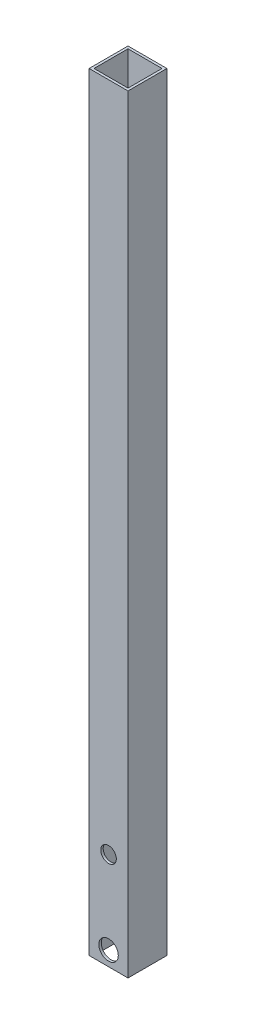
ISO-10303-21;
HEADER;
FILE_DESCRIPTION(('STEP AP214'),'2;1');
FILE_NAME('part.step','',(''),(''),'','','');
FILE_SCHEMA(('AUTOMOTIVE_DESIGN { 1 0 10303 214 1 1 1 1 }'));
ENDSEC;
DATA;
#1=APPLICATION_CONTEXT('core data for automotive mechanical design processes');
#2=APPLICATION_PROTOCOL_DEFINITION('international standard','automotive_design',2000,#1);
#3=PRODUCT_CONTEXT('',#1,'mechanical');
#4=PRODUCT('Part','Part','',(#3));
#5=PRODUCT_RELATED_PRODUCT_CATEGORY('part','',(#4));
#6=PRODUCT_DEFINITION_FORMATION('','',#4);
#7=PRODUCT_DEFINITION_CONTEXT('part definition',#1,'design');
#8=PRODUCT_DEFINITION('design','',#6,#7);
#9=PRODUCT_DEFINITION_SHAPE('','',#8);
#10=(LENGTH_UNIT() NAMED_UNIT(*) SI_UNIT(.MILLI.,.METRE.));
#11=(NAMED_UNIT(*) PLANE_ANGLE_UNIT() SI_UNIT($,.RADIAN.));
#12=(NAMED_UNIT(*) SI_UNIT($,.STERADIAN.) SOLID_ANGLE_UNIT());
#13=UNCERTAINTY_MEASURE_WITH_UNIT(LENGTH_MEASURE(1.E-05),#10,'distance_accuracy_value','');
#14=(GEOMETRIC_REPRESENTATION_CONTEXT(3) GLOBAL_UNCERTAINTY_ASSIGNED_CONTEXT((#13)) GLOBAL_UNIT_ASSIGNED_CONTEXT((#10,
#11,#12)) REPRESENTATION_CONTEXT('',''));
#15=CARTESIAN_POINT('',(0.,0.,0.));
#16=DIRECTION('',(0.,0.,1.));
#17=DIRECTION('',(1.,0.,0.));
#18=AXIS2_PLACEMENT_3D('',#15,#16,#17);
#19=CARTESIAN_POINT('',(0.,501.65,0.));
#20=DIRECTION('',(0.,1.,0.));
#21=DIRECTION('',(0.,0.,1.));
#22=AXIS2_PLACEMENT_3D('',#19,#20,#21);
#23=PLANE('',#22);
#24=DIRECTION('',(0.,0.,-1.));
#25=VECTOR('',#24,1.);
#26=CARTESIAN_POINT('',(12.7,501.65,-12.7));
#27=LINE('',#26,#25);
#28=CARTESIAN_POINT('',(12.7,501.65,12.7));
#29=VERTEX_POINT('',#28);
#30=CARTESIAN_POINT('',(12.7,501.65,-12.7));
#31=VERTEX_POINT('',#30);
#32=EDGE_CURVE('E137',#29,#31,#27,.T.);
#33=ORIENTED_EDGE('',*,*,#32,.T.);
#34=DIRECTION('',(-1.,0.,0.));
#35=VECTOR('',#34,1.);
#36=CARTESIAN_POINT('',(-12.7,501.65,-12.7));
#37=LINE('',#36,#35);
#38=CARTESIAN_POINT('',(-12.7,501.65,-12.7));
#39=VERTEX_POINT('',#38);
#40=EDGE_CURVE('E140',#31,#39,#37,.T.);
#41=ORIENTED_EDGE('',*,*,#40,.T.);
#42=DIRECTION('',(0.,0.,1.));
#43=VECTOR('',#42,1.);
#44=CARTESIAN_POINT('',(-12.7,501.65,-12.7));
#45=LINE('',#44,#43);
#46=CARTESIAN_POINT('',(-12.7,501.65,12.7));
#47=VERTEX_POINT('',#46);
#48=EDGE_CURVE('E143',#39,#47,#45,.T.);
#49=ORIENTED_EDGE('',*,*,#48,.T.);
#50=DIRECTION('',(1.,0.,0.));
#51=VECTOR('',#50,1.);
#52=CARTESIAN_POINT('',(-12.7,501.65,12.7));
#53=LINE('',#52,#51);
#54=EDGE_CURVE('E145',#47,#29,#53,.T.);
#55=ORIENTED_EDGE('',*,*,#54,.T.);
#56=EDGE_LOOP('',(#33,#41,#49,#55));
#57=FACE_BOUND('',#56,.T.);
#58=DIRECTION('',(0.,0.,1.));
#59=VECTOR('',#58,1.);
#60=CARTESIAN_POINT('',(-11.1125,501.65,-11.1125));
#61=LINE('',#60,#59);
#62=CARTESIAN_POINT('',(-11.1125,501.65,-11.1125));
#63=VERTEX_POINT('',#62);
#64=CARTESIAN_POINT('',(-11.1125,501.65,11.1125));
#65=VERTEX_POINT('',#64);
#66=EDGE_CURVE('E107',#63,#65,#61,.T.);
#67=ORIENTED_EDGE('',*,*,#66,.F.);
#68=DIRECTION('',(-1.,0.,0.));
#69=VECTOR('',#68,1.);
#70=CARTESIAN_POINT('',(-11.1125,501.65,-11.1125));
#71=LINE('',#70,#69);
#72=CARTESIAN_POINT('',(11.1125,501.65,-11.1125));
#73=VERTEX_POINT('',#72);
#74=EDGE_CURVE('E99',#73,#63,#71,.T.);
#75=ORIENTED_EDGE('',*,*,#74,.F.);
#76=DIRECTION('',(0.,0.,-1.));
#77=VECTOR('',#76,1.);
#78=CARTESIAN_POINT('',(11.1125,501.65,-11.1125));
#79=LINE('',#78,#77);
#80=CARTESIAN_POINT('',(11.1125,501.65,11.1125));
#81=VERTEX_POINT('',#80);
#82=EDGE_CURVE('E121',#81,#73,#79,.T.);
#83=ORIENTED_EDGE('',*,*,#82,.F.);
#84=DIRECTION('',(1.,0.,0.));
#85=VECTOR('',#84,1.);
#86=CARTESIAN_POINT('',(-11.1125,501.65,11.1125));
#87=LINE('',#86,#85);
#88=EDGE_CURVE('E119',#65,#81,#87,.T.);
#89=ORIENTED_EDGE('',*,*,#88,.F.);
#90=EDGE_LOOP('',(#67,#75,#83,#89));
#91=FACE_BOUND('',#90,.T.);
#92=ADVANCED_FACE('F33',(#57,#91),#23,.T.);
#93=CARTESIAN_POINT('',(0.,0.,0.));
#94=DIRECTION('',(0.,1.,0.));
#95=DIRECTION('',(0.,0.,1.));
#96=AXIS2_PLACEMENT_3D('',#93,#94,#95);
#97=PLANE('',#96);
#98=DIRECTION('',(0.,0.,-1.));
#99=VECTOR('',#98,1.);
#100=CARTESIAN_POINT('',(12.7,0.,-12.7));
#101=LINE('',#100,#99);
#102=CARTESIAN_POINT('',(12.7,0.,12.7));
#103=VERTEX_POINT('',#102);
#104=CARTESIAN_POINT('',(12.7,0.,-12.7));
#105=VERTEX_POINT('',#104);
#106=EDGE_CURVE('E115',#103,#105,#101,.T.);
#107=ORIENTED_EDGE('',*,*,#106,.F.);
#108=DIRECTION('',(1.,0.,0.));
#109=VECTOR('',#108,1.);
#110=CARTESIAN_POINT('',(-12.7,0.,12.7));
#111=LINE('',#110,#109);
#112=CARTESIAN_POINT('',(-12.7,0.,12.7));
#113=VERTEX_POINT('',#112);
#114=EDGE_CURVE('E141',#113,#103,#111,.T.);
#115=ORIENTED_EDGE('',*,*,#114,.F.);
#116=DIRECTION('',(0.,0.,1.));
#117=VECTOR('',#116,1.);
#118=CARTESIAN_POINT('',(-12.7,0.,-12.7));
#119=LINE('',#118,#117);
#120=CARTESIAN_POINT('',(-12.7,0.,-12.7));
#121=VERTEX_POINT('',#120);
#122=EDGE_CURVE('E152',#121,#113,#119,.T.);
#123=ORIENTED_EDGE('',*,*,#122,.F.);
#124=DIRECTION('',(-1.,0.,0.));
#125=VECTOR('',#124,1.);
#126=CARTESIAN_POINT('',(-12.7,0.,-12.7));
#127=LINE('',#126,#125);
#128=EDGE_CURVE('E150',#105,#121,#127,.T.);
#129=ORIENTED_EDGE('',*,*,#128,.F.);
#130=EDGE_LOOP('',(#107,#115,#123,#129));
#131=FACE_BOUND('',#130,.T.);
#132=DIRECTION('',(-1.,0.,0.));
#133=VECTOR('',#132,1.);
#134=CARTESIAN_POINT('',(-11.1125,0.,-11.1125));
#135=LINE('',#134,#133);
#136=CARTESIAN_POINT('',(11.1125,0.,-11.1125));
#137=VERTEX_POINT('',#136);
#138=CARTESIAN_POINT('',(-11.1125,0.,-11.1125));
#139=VERTEX_POINT('',#138);
#140=EDGE_CURVE('E57',#137,#139,#135,.T.);
#141=ORIENTED_EDGE('',*,*,#140,.T.);
#142=DIRECTION('',(0.,0.,1.));
#143=VECTOR('',#142,1.);
#144=CARTESIAN_POINT('',(-11.1125,0.,-11.1125));
#145=LINE('',#144,#143);
#146=CARTESIAN_POINT('',(-11.1125,0.,11.1125));
#147=VERTEX_POINT('',#146);
#148=EDGE_CURVE('E114',#139,#147,#145,.T.);
#149=ORIENTED_EDGE('',*,*,#148,.T.);
#150=DIRECTION('',(1.,0.,0.));
#151=VECTOR('',#150,1.);
#152=CARTESIAN_POINT('',(-11.1125,0.,11.1125));
#153=LINE('',#152,#151);
#154=CARTESIAN_POINT('',(11.1125,0.,11.1125));
#155=VERTEX_POINT('',#154);
#156=EDGE_CURVE('E129',#147,#155,#153,.T.);
#157=ORIENTED_EDGE('',*,*,#156,.T.);
#158=DIRECTION('',(0.,0.,-1.));
#159=VECTOR('',#158,1.);
#160=CARTESIAN_POINT('',(11.1125,0.,-11.1125));
#161=LINE('',#160,#159);
#162=EDGE_CURVE('E108',#155,#137,#161,.T.);
#163=ORIENTED_EDGE('',*,*,#162,.T.);
#164=EDGE_LOOP('',(#141,#149,#157,#163));
#165=FACE_BOUND('',#164,.T.);
#166=ADVANCED_FACE('F171',(#131,#165),#97,.F.);
#167=CARTESIAN_POINT('',(12.7,501.65,-12.7));
#168=DIRECTION('',(-1.,0.,0.));
#169=DIRECTION('',(0.,0.,1.));
#170=AXIS2_PLACEMENT_3D('',#167,#168,#169);
#171=PLANE('',#170);
#172=ORIENTED_EDGE('',*,*,#106,.T.);
#173=DIRECTION('',(0.,-1.,0.));
#174=VECTOR('',#173,1.);
#175=CARTESIAN_POINT('',(12.7,501.65,-12.7));
#176=LINE('',#175,#174);
#177=EDGE_CURVE('E11',#31,#105,#176,.T.);
#178=ORIENTED_EDGE('',*,*,#177,.F.);
#179=ORIENTED_EDGE('',*,*,#32,.F.);
#180=DIRECTION('',(0.,-1.,0.));
#181=VECTOR('',#180,1.);
#182=CARTESIAN_POINT('',(12.7,501.65,12.7));
#183=LINE('',#182,#181);
#184=EDGE_CURVE('E147',#29,#103,#183,.T.);
#185=ORIENTED_EDGE('',*,*,#184,.T.);
#186=EDGE_LOOP('',(#172,#178,#179,#185));
#187=FACE_BOUND('',#186,.T.);
#188=ADVANCED_FACE('F35',(#187),#171,.F.);
#189=CARTESIAN_POINT('',(-12.7,501.65,-12.7));
#190=DIRECTION('',(0.,0.,1.));
#191=DIRECTION('',(1.,0.,0.));
#192=AXIS2_PLACEMENT_3D('',#189,#190,#191);
#193=PLANE('',#192);
#194=CARTESIAN_POINT('',(0.,9.525,-12.7));
#195=DIRECTION('',(0.,0.,1.));
#196=DIRECTION('',(1.,0.,0.));
#197=AXIS2_PLACEMENT_3D('',#194,#195,#196);
#198=CIRCLE('',#197,6.35);
#199=CARTESIAN_POINT('',(6.35,9.525,-12.7));
#200=VERTEX_POINT('',#199);
#201=EDGE_CURVE('E213',#200,#200,#198,.T.);
#202=ORIENTED_EDGE('',*,*,#201,.T.);
#203=EDGE_LOOP('',(#202));
#204=FACE_BOUND('',#203,.T.);
#205=ORIENTED_EDGE('',*,*,#128,.T.);
#206=DIRECTION('',(0.,-1.,0.));
#207=VECTOR('',#206,1.);
#208=CARTESIAN_POINT('',(-12.7,501.65,-12.7));
#209=LINE('',#208,#207);
#210=EDGE_CURVE('E42',#39,#121,#209,.T.);
#211=ORIENTED_EDGE('',*,*,#210,.F.);
#212=ORIENTED_EDGE('',*,*,#40,.F.);
#213=ORIENTED_EDGE('',*,*,#177,.T.);
#214=EDGE_LOOP('',(#205,#211,#212,#213));
#215=FACE_BOUND('',#214,.T.);
#216=ADVANCED_FACE('F181',(#204,#215),#193,.F.);
#217=CARTESIAN_POINT('',(-12.7,501.65,-12.7));
#218=DIRECTION('',(1.,0.,0.));
#219=DIRECTION('',(0.,0.,-1.));
#220=AXIS2_PLACEMENT_3D('',#217,#218,#219);
#221=PLANE('',#220);
#222=ORIENTED_EDGE('',*,*,#122,.T.);
#223=DIRECTION('',(0.,-1.,0.));
#224=VECTOR('',#223,1.);
#225=CARTESIAN_POINT('',(-12.7,501.65,12.7));
#226=LINE('',#225,#224);
#227=EDGE_CURVE('E157',#47,#113,#226,.T.);
#228=ORIENTED_EDGE('',*,*,#227,.F.);
#229=ORIENTED_EDGE('',*,*,#48,.F.);
#230=ORIENTED_EDGE('',*,*,#210,.T.);
#231=EDGE_LOOP('',(#222,#228,#229,#230));
#232=FACE_BOUND('',#231,.T.);
#233=ADVANCED_FACE('F165',(#232),#221,.F.);
#234=CARTESIAN_POINT('',(-12.7,501.65,12.7));
#235=DIRECTION('',(0.,0.,-1.));
#236=DIRECTION('',(-1.,0.,0.));
#237=AXIS2_PLACEMENT_3D('',#234,#235,#236);
#238=PLANE('',#237);
#239=CARTESIAN_POINT('',(0.,63.5,12.7));
#240=DIRECTION('',(0.,0.,1.));
#241=DIRECTION('',(1.,0.,0.));
#242=AXIS2_PLACEMENT_3D('',#239,#240,#241);
#243=CIRCLE('',#242,5.08);
#244=CARTESIAN_POINT('',(5.08,63.5,12.7));
#245=VERTEX_POINT('',#244);
#246=EDGE_CURVE('E208',#245,#245,#243,.T.);
#247=ORIENTED_EDGE('',*,*,#246,.F.);
#248=EDGE_LOOP('',(#247));
#249=FACE_BOUND('',#248,.T.);
#250=CARTESIAN_POINT('',(0.,9.525,12.7));
#251=DIRECTION('',(0.,0.,1.));
#252=DIRECTION('',(1.,0.,0.));
#253=AXIS2_PLACEMENT_3D('',#250,#251,#252);
#254=CIRCLE('',#253,6.35);
#255=CARTESIAN_POINT('',(6.35,9.525,12.7));
#256=VERTEX_POINT('',#255);
#257=EDGE_CURVE('E211',#256,#256,#254,.T.);
#258=ORIENTED_EDGE('',*,*,#257,.F.);
#259=EDGE_LOOP('',(#258));
#260=FACE_BOUND('',#259,.T.);
#261=ORIENTED_EDGE('',*,*,#114,.T.);
#262=ORIENTED_EDGE('',*,*,#184,.F.);
#263=ORIENTED_EDGE('',*,*,#54,.F.);
#264=ORIENTED_EDGE('',*,*,#227,.T.);
#265=EDGE_LOOP('',(#261,#262,#263,#264));
#266=FACE_BOUND('',#265,.T.);
#267=ADVANCED_FACE('F175',(#249,#260,#266),#238,.F.);
#268=CARTESIAN_POINT('',(-11.1125,501.65,-11.1125));
#269=DIRECTION('',(0.,0.,1.));
#270=DIRECTION('',(1.,0.,0.));
#271=AXIS2_PLACEMENT_3D('',#268,#269,#270);
#272=PLANE('',#271);
#273=CARTESIAN_POINT('',(0.,9.525,-11.1125));
#274=DIRECTION('',(0.,0.,1.));
#275=DIRECTION('',(1.,0.,0.));
#276=AXIS2_PLACEMENT_3D('',#273,#274,#275);
#277=CIRCLE('',#276,6.35);
#278=CARTESIAN_POINT('',(6.35,9.525,-11.1125));
#279=VERTEX_POINT('',#278);
#280=EDGE_CURVE('E127',#279,#279,#277,.T.);
#281=ORIENTED_EDGE('',*,*,#280,.F.);
#282=EDGE_LOOP('',(#281));
#283=FACE_BOUND('',#282,.T.);
#284=ORIENTED_EDGE('',*,*,#140,.F.);
#285=DIRECTION('',(0.,-1.,0.));
#286=VECTOR('',#285,1.);
#287=CARTESIAN_POINT('',(11.1125,501.65,-11.1125));
#288=LINE('',#287,#286);
#289=EDGE_CURVE('E103',#73,#137,#288,.T.);
#290=ORIENTED_EDGE('',*,*,#289,.F.);
#291=ORIENTED_EDGE('',*,*,#74,.T.);
#292=DIRECTION('',(0.,-1.,0.));
#293=VECTOR('',#292,1.);
#294=CARTESIAN_POINT('',(-11.1125,501.65,-11.1125));
#295=LINE('',#294,#293);
#296=EDGE_CURVE('E102',#63,#139,#295,.T.);
#297=ORIENTED_EDGE('',*,*,#296,.T.);
#298=EDGE_LOOP('',(#284,#290,#291,#297));
#299=FACE_BOUND('',#298,.T.);
#300=ADVANCED_FACE('F101',(#283,#299),#272,.T.);
#301=CARTESIAN_POINT('',(-11.1125,501.65,-11.1125));
#302=DIRECTION('',(1.,0.,0.));
#303=DIRECTION('',(0.,0.,-1.));
#304=AXIS2_PLACEMENT_3D('',#301,#302,#303);
#305=PLANE('',#304);
#306=ORIENTED_EDGE('',*,*,#148,.F.);
#307=ORIENTED_EDGE('',*,*,#296,.F.);
#308=ORIENTED_EDGE('',*,*,#66,.T.);
#309=DIRECTION('',(0.,-1.,0.));
#310=VECTOR('',#309,1.);
#311=CARTESIAN_POINT('',(-11.1125,501.65,11.1125));
#312=LINE('',#311,#310);
#313=EDGE_CURVE('E116',#65,#147,#312,.T.);
#314=ORIENTED_EDGE('',*,*,#313,.T.);
#315=EDGE_LOOP('',(#306,#307,#308,#314));
#316=FACE_BOUND('',#315,.T.);
#317=ADVANCED_FACE('F111',(#316),#305,.T.);
#318=CARTESIAN_POINT('',(-11.1125,501.65,11.1125));
#319=DIRECTION('',(0.,0.,-1.));
#320=DIRECTION('',(-1.,0.,0.));
#321=AXIS2_PLACEMENT_3D('',#318,#319,#320);
#322=PLANE('',#321);
#323=CARTESIAN_POINT('',(0.,63.5,11.1125));
#324=DIRECTION('',(0.,0.,-1.));
#325=DIRECTION('',(-1.,0.,0.));
#326=AXIS2_PLACEMENT_3D('',#323,#324,#325);
#327=CIRCLE('',#326,5.08);
#328=CARTESIAN_POINT('',(-5.08,63.5,11.1125));
#329=VERTEX_POINT('',#328);
#330=EDGE_CURVE('E214',#329,#329,#327,.F.);
#331=ORIENTED_EDGE('',*,*,#330,.T.);
#332=EDGE_LOOP('',(#331));
#333=FACE_BOUND('',#332,.T.);
#334=CARTESIAN_POINT('',(0.,9.525,11.1125));
#335=DIRECTION('',(0.,0.,-1.));
#336=DIRECTION('',(-1.,0.,0.));
#337=AXIS2_PLACEMENT_3D('',#334,#335,#336);
#338=CIRCLE('',#337,6.35);
#339=CARTESIAN_POINT('',(-6.35,9.525,11.1125));
#340=VERTEX_POINT('',#339);
#341=EDGE_CURVE('E37',#340,#340,#338,.T.);
#342=ORIENTED_EDGE('',*,*,#341,.F.);
#343=EDGE_LOOP('',(#342));
#344=FACE_BOUND('',#343,.T.);
#345=ORIENTED_EDGE('',*,*,#156,.F.);
#346=ORIENTED_EDGE('',*,*,#313,.F.);
#347=ORIENTED_EDGE('',*,*,#88,.T.);
#348=DIRECTION('',(0.,-1.,0.));
#349=VECTOR('',#348,1.);
#350=CARTESIAN_POINT('',(11.1125,501.65,11.1125));
#351=LINE('',#350,#349);
#352=EDGE_CURVE('E49',#81,#155,#351,.T.);
#353=ORIENTED_EDGE('',*,*,#352,.T.);
#354=EDGE_LOOP('',(#345,#346,#347,#353));
#355=FACE_BOUND('',#354,.T.);
#356=ADVANCED_FACE('F227',(#333,#344,#355),#322,.T.);
#357=CARTESIAN_POINT('',(11.1125,501.65,-11.1125));
#358=DIRECTION('',(-1.,0.,0.));
#359=DIRECTION('',(0.,0.,1.));
#360=AXIS2_PLACEMENT_3D('',#357,#358,#359);
#361=PLANE('',#360);
#362=ORIENTED_EDGE('',*,*,#162,.F.);
#363=ORIENTED_EDGE('',*,*,#352,.F.);
#364=ORIENTED_EDGE('',*,*,#82,.T.);
#365=ORIENTED_EDGE('',*,*,#289,.T.);
#366=EDGE_LOOP('',(#362,#363,#364,#365));
#367=FACE_BOUND('',#366,.T.);
#368=ADVANCED_FACE('F230',(#367),#361,.T.);
#369=CARTESIAN_POINT('',(0.,9.525,-12.7));
#370=DIRECTION('',(0.,0.,1.));
#371=DIRECTION('',(1.,0.,0.));
#372=AXIS2_PLACEMENT_3D('',#369,#370,#371);
#373=CYLINDRICAL_SURFACE('',#372,6.35);
#374=ORIENTED_EDGE('',*,*,#341,.T.);
#375=EDGE_LOOP('',(#374));
#376=FACE_BOUND('',#375,.T.);
#377=ORIENTED_EDGE('',*,*,#257,.T.);
#378=EDGE_LOOP('',(#377));
#379=FACE_BOUND('',#378,.T.);
#380=ADVANCED_FACE('F225',(#376,#379),#373,.F.);
#381=ORIENTED_EDGE('',*,*,#280,.T.);
#382=EDGE_LOOP('',(#381));
#383=FACE_BOUND('',#382,.T.);
#384=ORIENTED_EDGE('',*,*,#201,.F.);
#385=EDGE_LOOP('',(#384));
#386=FACE_BOUND('',#385,.T.);
#387=ADVANCED_FACE('F239',(#383,#386),#373,.F.);
#388=CARTESIAN_POINT('',(0.,63.5,-3.25590979371065));
#389=DIRECTION('',(0.,0.,1.));
#390=DIRECTION('',(1.,0.,0.));
#391=AXIS2_PLACEMENT_3D('',#388,#389,#390);
#392=CYLINDRICAL_SURFACE('',#391,5.08);
#393=ORIENTED_EDGE('',*,*,#246,.T.);
#394=EDGE_LOOP('',(#393));
#395=FACE_BOUND('',#394,.T.);
#396=ORIENTED_EDGE('',*,*,#330,.F.);
#397=EDGE_LOOP('',(#396));
#398=FACE_BOUND('',#397,.T.);
#399=ADVANCED_FACE('F261',(#395,#398),#392,.F.);
#400=CLOSED_SHELL('',(#92,#166,#188,#216,#233,#267,#300,#317,#356,#368,#380,#387,#399));
#401=MANIFOLD_SOLID_BREP('B2',#400);
#402=ADVANCED_BREP_SHAPE_REPRESENTATION('',(#18,#401),#14);
#403=SHAPE_DEFINITION_REPRESENTATION(#9,#402);
ENDSEC;
END-ISO-10303-21;
